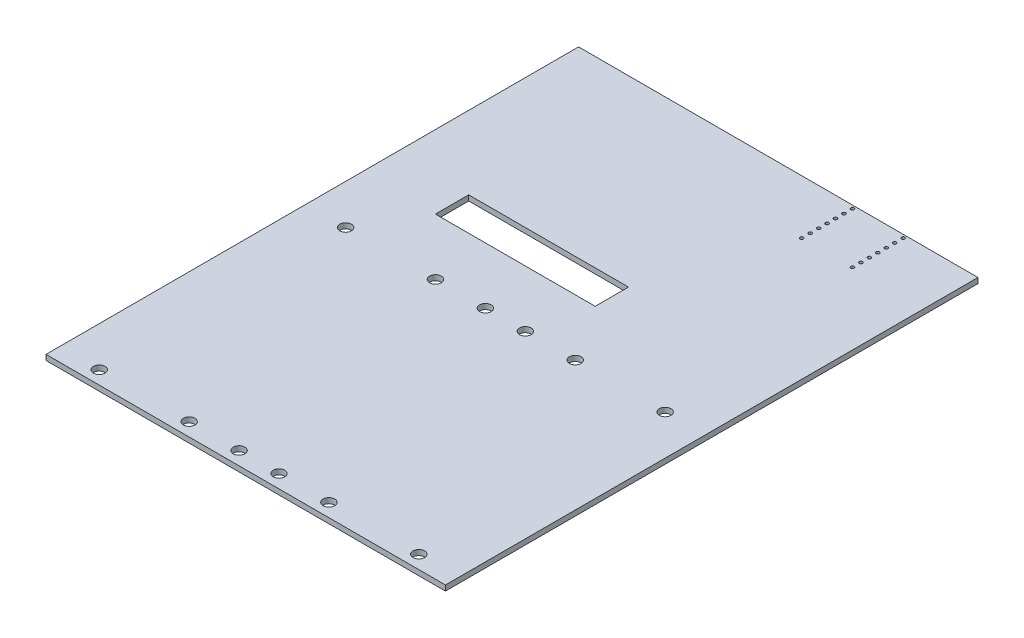
ISO-10303-21;
HEADER;
FILE_DESCRIPTION(('STEP AP214'),'2;1');
FILE_NAME('part.step','',(''),(''),'','','');
FILE_SCHEMA(('AUTOMOTIVE_DESIGN { 1 0 10303 214 1 1 1 1 }'));
ENDSEC;
DATA;
#1=APPLICATION_CONTEXT('core data for automotive mechanical design processes');
#2=APPLICATION_PROTOCOL_DEFINITION('international standard','automotive_design',2000,#1);
#3=PRODUCT_CONTEXT('',#1,'mechanical');
#4=PRODUCT('Part','Part','',(#3));
#5=PRODUCT_RELATED_PRODUCT_CATEGORY('part','',(#4));
#6=PRODUCT_DEFINITION_FORMATION('','',#4);
#7=PRODUCT_DEFINITION_CONTEXT('part definition',#1,'design');
#8=PRODUCT_DEFINITION('design','',#6,#7);
#9=PRODUCT_DEFINITION_SHAPE('','',#8);
#10=(LENGTH_UNIT() NAMED_UNIT(*) SI_UNIT(.MILLI.,.METRE.));
#11=(NAMED_UNIT(*) PLANE_ANGLE_UNIT() SI_UNIT($,.RADIAN.));
#12=(NAMED_UNIT(*) SI_UNIT($,.STERADIAN.) SOLID_ANGLE_UNIT());
#13=UNCERTAINTY_MEASURE_WITH_UNIT(LENGTH_MEASURE(1.E-05),#10,'distance_accuracy_value','');
#14=(GEOMETRIC_REPRESENTATION_CONTEXT(3) GLOBAL_UNCERTAINTY_ASSIGNED_CONTEXT((#13)) GLOBAL_UNIT_ASSIGNED_CONTEXT((#10,
#11,#12)) REPRESENTATION_CONTEXT('',''));
#15=CARTESIAN_POINT('',(0.,0.,0.));
#16=DIRECTION('',(0.,0.,1.));
#17=DIRECTION('',(1.,0.,0.));
#18=AXIS2_PLACEMENT_3D('',#15,#16,#17);
#19=CARTESIAN_POINT('',(0.,1.6,65.));
#20=DIRECTION('',(0.,0.,1.));
#21=DIRECTION('',(1.,0.,0.));
#22=AXIS2_PLACEMENT_3D('',#19,#20,#21);
#23=PLANE('',#22);
#24=DIRECTION('',(-1.,0.,0.));
#25=VECTOR('',#24,1.);
#26=CARTESIAN_POINT('',(0.,0.,65.));
#27=LINE('',#26,#25);
#28=CARTESIAN_POINT('',(70.,0.,65.));
#29=VERTEX_POINT('',#28);
#30=CARTESIAN_POINT('',(22.,0.,65.));
#31=VERTEX_POINT('',#30);
#32=EDGE_CURVE('E222',#29,#31,#27,.T.);
#33=ORIENTED_EDGE('',*,*,#32,.T.);
#34=DIRECTION('',(0.,-1.,0.));
#35=VECTOR('',#34,1.);
#36=CARTESIAN_POINT('',(22.,1.6,65.));
#37=LINE('',#36,#35);
#38=CARTESIAN_POINT('',(22.,1.6,65.));
#39=VERTEX_POINT('',#38);
#40=EDGE_CURVE('E11',#39,#31,#37,.T.);
#41=ORIENTED_EDGE('',*,*,#40,.F.);
#42=DIRECTION('',(-1.,0.,0.));
#43=VECTOR('',#42,1.);
#44=CARTESIAN_POINT('',(0.,1.6,65.));
#45=LINE('',#44,#43);
#46=CARTESIAN_POINT('',(70.,1.6,65.));
#47=VERTEX_POINT('',#46);
#48=EDGE_CURVE('E116',#47,#39,#45,.T.);
#49=ORIENTED_EDGE('',*,*,#48,.F.);
#50=DIRECTION('',(0.,-1.,0.));
#51=VECTOR('',#50,1.);
#52=CARTESIAN_POINT('',(70.,1.6,65.));
#53=LINE('',#52,#51);
#54=EDGE_CURVE('E54',#47,#29,#53,.T.);
#55=ORIENTED_EDGE('',*,*,#54,.T.);
#56=EDGE_LOOP('',(#33,#41,#49,#55));
#57=FACE_BOUND('',#56,.T.);
#58=ADVANCED_FACE('F35',(#57),#23,.F.);
#59=CARTESIAN_POINT('',(22.,1.6,0.));
#60=DIRECTION('',(-1.,0.,0.));
#61=DIRECTION('',(0.,0.,1.));
#62=AXIS2_PLACEMENT_3D('',#59,#60,#61);
#63=PLANE('',#62);
#64=DIRECTION('',(0.,0.,-1.));
#65=VECTOR('',#64,1.);
#66=CARTESIAN_POINT('',(22.,0.,0.));
#67=LINE('',#66,#65);
#68=CARTESIAN_POINT('',(22.,0.,55.));
#69=VERTEX_POINT('',#68);
#70=EDGE_CURVE('E122',#31,#69,#67,.T.);
#71=ORIENTED_EDGE('',*,*,#70,.T.);
#72=DIRECTION('',(0.,-1.,0.));
#73=VECTOR('',#72,1.);
#74=CARTESIAN_POINT('',(22.,1.6,55.));
#75=LINE('',#74,#73);
#76=CARTESIAN_POINT('',(22.,1.6,55.));
#77=VERTEX_POINT('',#76);
#78=EDGE_CURVE('E45',#77,#69,#75,.T.);
#79=ORIENTED_EDGE('',*,*,#78,.F.);
#80=DIRECTION('',(0.,0.,-1.));
#81=VECTOR('',#80,1.);
#82=CARTESIAN_POINT('',(22.,1.6,0.));
#83=LINE('',#82,#81);
#84=EDGE_CURVE('E109',#39,#77,#83,.T.);
#85=ORIENTED_EDGE('',*,*,#84,.F.);
#86=ORIENTED_EDGE('',*,*,#40,.T.);
#87=EDGE_LOOP('',(#71,#79,#85,#86));
#88=FACE_BOUND('',#87,.T.);
#89=ADVANCED_FACE('F121',(#88),#63,.F.);
#90=CARTESIAN_POINT('',(0.,1.6,55.));
#91=DIRECTION('',(0.,0.,1.));
#92=DIRECTION('',(1.,0.,0.));
#93=AXIS2_PLACEMENT_3D('',#90,#91,#92);
#94=PLANE('',#93);
#95=DIRECTION('',(-1.,0.,0.));
#96=VECTOR('',#95,1.);
#97=CARTESIAN_POINT('',(0.,0.,55.));
#98=LINE('',#97,#96);
#99=CARTESIAN_POINT('',(70.,0.,55.));
#100=VERTEX_POINT('',#99);
#101=EDGE_CURVE('E225',#100,#69,#98,.T.);
#102=ORIENTED_EDGE('',*,*,#101,.F.);
#103=DIRECTION('',(0.,-1.,0.));
#104=VECTOR('',#103,1.);
#105=CARTESIAN_POINT('',(70.,1.6,55.));
#106=LINE('',#105,#104);
#107=CARTESIAN_POINT('',(70.,1.6,55.));
#108=VERTEX_POINT('',#107);
#109=EDGE_CURVE('E80',#108,#100,#106,.T.);
#110=ORIENTED_EDGE('',*,*,#109,.F.);
#111=DIRECTION('',(-1.,0.,0.));
#112=VECTOR('',#111,1.);
#113=CARTESIAN_POINT('',(0.,1.6,55.));
#114=LINE('',#113,#112);
#115=EDGE_CURVE('E115',#108,#77,#114,.T.);
#116=ORIENTED_EDGE('',*,*,#115,.T.);
#117=ORIENTED_EDGE('',*,*,#78,.T.);
#118=EDGE_LOOP('',(#102,#110,#116,#117));
#119=FACE_BOUND('',#118,.T.);
#120=ADVANCED_FACE('F126',(#119),#94,.T.);
#121=CARTESIAN_POINT('',(0.,1.6,160.));
#122=DIRECTION('',(0.,0.,-1.));
#123=DIRECTION('',(-1.,0.,0.));
#124=AXIS2_PLACEMENT_3D('',#121,#122,#123);
#125=PLANE('',#124);
#126=DIRECTION('',(1.,0.,0.));
#127=VECTOR('',#126,1.);
#128=CARTESIAN_POINT('',(0.,0.,160.));
#129=LINE('',#128,#127);
#130=CARTESIAN_POINT('',(0.,0.,160.));
#131=VERTEX_POINT('',#130);
#132=CARTESIAN_POINT('',(120.,0.,160.));
#133=VERTEX_POINT('',#132);
#134=EDGE_CURVE('E211',#131,#133,#129,.T.);
#135=ORIENTED_EDGE('',*,*,#134,.T.);
#136=DIRECTION('',(0.,-1.,0.));
#137=VECTOR('',#136,1.);
#138=CARTESIAN_POINT('',(120.,1.6,160.));
#139=LINE('',#138,#137);
#140=CARTESIAN_POINT('',(120.,1.6,160.));
#141=VERTEX_POINT('',#140);
#142=EDGE_CURVE('E39',#141,#133,#139,.T.);
#143=ORIENTED_EDGE('',*,*,#142,.F.);
#144=DIRECTION('',(1.,0.,0.));
#145=VECTOR('',#144,1.);
#146=CARTESIAN_POINT('',(0.,1.6,160.));
#147=LINE('',#146,#145);
#148=CARTESIAN_POINT('',(0.,1.6,160.));
#149=VERTEX_POINT('',#148);
#150=EDGE_CURVE('E93',#149,#141,#147,.T.);
#151=ORIENTED_EDGE('',*,*,#150,.F.);
#152=DIRECTION('',(0.,-1.,0.));
#153=VECTOR('',#152,1.);
#154=CARTESIAN_POINT('',(0.,1.6,160.));
#155=LINE('',#154,#153);
#156=EDGE_CURVE('E210',#149,#131,#155,.T.);
#157=ORIENTED_EDGE('',*,*,#156,.T.);
#158=EDGE_LOOP('',(#135,#143,#151,#157));
#159=FACE_BOUND('',#158,.T.);
#160=ADVANCED_FACE('F37',(#159),#125,.F.);
#161=CARTESIAN_POINT('',(120.,1.6,0.));
#162=DIRECTION('',(1.,0.,0.));
#163=DIRECTION('',(0.,0.,-1.));
#164=AXIS2_PLACEMENT_3D('',#161,#162,#163);
#165=PLANE('',#164);
#166=DIRECTION('',(0.,0.,1.));
#167=VECTOR('',#166,1.);
#168=CARTESIAN_POINT('',(120.,0.,0.));
#169=LINE('',#168,#167);
#170=CARTESIAN_POINT('',(120.,0.,0.));
#171=VERTEX_POINT('',#170);
#172=EDGE_CURVE('E214',#171,#133,#169,.T.);
#173=ORIENTED_EDGE('',*,*,#172,.F.);
#174=DIRECTION('',(0.,-1.,0.));
#175=VECTOR('',#174,1.);
#176=CARTESIAN_POINT('',(120.,1.6,0.));
#177=LINE('',#176,#175);
#178=CARTESIAN_POINT('',(120.,1.6,0.));
#179=VERTEX_POINT('',#178);
#180=EDGE_CURVE('E313',#179,#171,#177,.T.);
#181=ORIENTED_EDGE('',*,*,#180,.F.);
#182=DIRECTION('',(0.,0.,1.));
#183=VECTOR('',#182,1.);
#184=CARTESIAN_POINT('',(120.,1.6,0.));
#185=LINE('',#184,#183);
#186=EDGE_CURVE('E321',#179,#141,#185,.T.);
#187=ORIENTED_EDGE('',*,*,#186,.T.);
#188=ORIENTED_EDGE('',*,*,#142,.T.);
#189=EDGE_LOOP('',(#173,#181,#187,#188));
#190=FACE_BOUND('',#189,.T.);
#191=ADVANCED_FACE('F320',(#190),#165,.T.);
#192=CARTESIAN_POINT('',(0.,1.6,0.));
#193=DIRECTION('',(0.,0.,-1.));
#194=DIRECTION('',(-1.,0.,0.));
#195=AXIS2_PLACEMENT_3D('',#192,#193,#194);
#196=PLANE('',#195);
#197=DIRECTION('',(1.,0.,0.));
#198=VECTOR('',#197,1.);
#199=CARTESIAN_POINT('',(0.,0.,0.));
#200=LINE('',#199,#198);
#201=CARTESIAN_POINT('',(0.,0.,0.));
#202=VERTEX_POINT('',#201);
#203=EDGE_CURVE('E217',#202,#171,#200,.T.);
#204=ORIENTED_EDGE('',*,*,#203,.F.);
#205=DIRECTION('',(0.,-1.,0.));
#206=VECTOR('',#205,1.);
#207=CARTESIAN_POINT('',(0.,1.6,0.));
#208=LINE('',#207,#206);
#209=CARTESIAN_POINT('',(0.,1.6,0.));
#210=VERTEX_POINT('',#209);
#211=EDGE_CURVE('E312',#210,#202,#208,.T.);
#212=ORIENTED_EDGE('',*,*,#211,.F.);
#213=DIRECTION('',(1.,0.,0.));
#214=VECTOR('',#213,1.);
#215=CARTESIAN_POINT('',(0.,1.6,0.));
#216=LINE('',#215,#214);
#217=EDGE_CURVE('E332',#210,#179,#216,.T.);
#218=ORIENTED_EDGE('',*,*,#217,.T.);
#219=ORIENTED_EDGE('',*,*,#180,.T.);
#220=EDGE_LOOP('',(#204,#212,#218,#219));
#221=FACE_BOUND('',#220,.T.);
#222=ADVANCED_FACE('F329',(#221),#196,.T.);
#223=CARTESIAN_POINT('',(12.,1.6,156.));
#224=DIRECTION('',(0.,-1.,0.));
#225=DIRECTION('',(0.,0.,-1.));
#226=AXIS2_PLACEMENT_3D('',#223,#224,#225);
#227=CYLINDRICAL_SURFACE('',#226,1.75);
#228=CARTESIAN_POINT('',(12.,1.6,156.));
#229=DIRECTION('',(0.,1.,0.));
#230=DIRECTION('',(0.,0.,1.));
#231=AXIS2_PLACEMENT_3D('',#228,#229,#230);
#232=CIRCLE('',#231,1.75);
#233=CARTESIAN_POINT('',(12.,1.6,157.75));
#234=VERTEX_POINT('',#233);
#235=EDGE_CURVE('E204',#234,#234,#232,.T.);
#236=ORIENTED_EDGE('',*,*,#235,.T.);
#237=EDGE_LOOP('',(#236));
#238=FACE_BOUND('',#237,.T.);
#239=CARTESIAN_POINT('',(12.,0.,156.));
#240=DIRECTION('',(0.,1.,0.));
#241=DIRECTION('',(0.,0.,1.));
#242=AXIS2_PLACEMENT_3D('',#239,#240,#241);
#243=CIRCLE('',#242,1.75);
#244=CARTESIAN_POINT('',(12.,0.,157.75));
#245=VERTEX_POINT('',#244);
#246=EDGE_CURVE('E302',#245,#245,#243,.T.);
#247=ORIENTED_EDGE('',*,*,#246,.F.);
#248=EDGE_LOOP('',(#247));
#249=FACE_BOUND('',#248,.T.);
#250=ADVANCED_FACE('F362',(#238,#249),#227,.F.);
#251=CARTESIAN_POINT('',(54.,1.6,82.));
#252=DIRECTION('',(0.,-1.,0.));
#253=DIRECTION('',(0.,0.,-1.));
#254=AXIS2_PLACEMENT_3D('',#251,#252,#253);
#255=CYLINDRICAL_SURFACE('',#254,1.75);
#256=CARTESIAN_POINT('',(54.,1.6,82.));
#257=DIRECTION('',(0.,1.,0.));
#258=DIRECTION('',(0.,0.,1.));
#259=AXIS2_PLACEMENT_3D('',#256,#257,#258);
#260=CIRCLE('',#259,1.75);
#261=CARTESIAN_POINT('',(54.,1.6,83.75));
#262=VERTEX_POINT('',#261);
#263=EDGE_CURVE('E201',#262,#262,#260,.T.);
#264=ORIENTED_EDGE('',*,*,#263,.T.);
#265=EDGE_LOOP('',(#264));
#266=FACE_BOUND('',#265,.T.);
#267=CARTESIAN_POINT('',(54.,0.,82.));
#268=DIRECTION('',(0.,1.,0.));
#269=DIRECTION('',(0.,0.,1.));
#270=AXIS2_PLACEMENT_3D('',#267,#268,#269);
#271=CIRCLE('',#270,1.75);
#272=CARTESIAN_POINT('',(54.,0.,83.75));
#273=VERTEX_POINT('',#272);
#274=EDGE_CURVE('E299',#273,#273,#271,.T.);
#275=ORIENTED_EDGE('',*,*,#274,.F.);
#276=EDGE_LOOP('',(#275));
#277=FACE_BOUND('',#276,.T.);
#278=ADVANCED_FACE('F466',(#266,#277),#255,.F.);
#279=CARTESIAN_POINT('',(54.,1.6,156.));
#280=DIRECTION('',(0.,-1.,0.));
#281=DIRECTION('',(0.,0.,-1.));
#282=AXIS2_PLACEMENT_3D('',#279,#280,#281);
#283=CYLINDRICAL_SURFACE('',#282,1.75);
#284=CARTESIAN_POINT('',(54.,1.6,156.));
#285=DIRECTION('',(0.,1.,0.));
#286=DIRECTION('',(0.,0.,1.));
#287=AXIS2_PLACEMENT_3D('',#284,#285,#286);
#288=CIRCLE('',#287,1.75);
#289=CARTESIAN_POINT('',(54.,1.6,157.75));
#290=VERTEX_POINT('',#289);
#291=EDGE_CURVE('E198',#290,#290,#288,.T.);
#292=ORIENTED_EDGE('',*,*,#291,.T.);
#293=EDGE_LOOP('',(#292));
#294=FACE_BOUND('',#293,.T.);
#295=CARTESIAN_POINT('',(54.,0.,156.));
#296=DIRECTION('',(0.,1.,0.));
#297=DIRECTION('',(0.,0.,1.));
#298=AXIS2_PLACEMENT_3D('',#295,#296,#297);
#299=CIRCLE('',#298,1.75);
#300=CARTESIAN_POINT('',(54.,0.,157.75));
#301=VERTEX_POINT('',#300);
#302=EDGE_CURVE('E296',#301,#301,#299,.T.);
#303=ORIENTED_EDGE('',*,*,#302,.F.);
#304=EDGE_LOOP('',(#303));
#305=FACE_BOUND('',#304,.T.);
#306=ADVANCED_FACE('F462',(#294,#305),#283,.F.);
#307=CARTESIAN_POINT('',(39.,1.6,156.));
#308=DIRECTION('',(0.,-1.,0.));
#309=DIRECTION('',(0.,0.,-1.));
#310=AXIS2_PLACEMENT_3D('',#307,#308,#309);
#311=CYLINDRICAL_SURFACE('',#310,1.75);
#312=CARTESIAN_POINT('',(39.,1.6,156.));
#313=DIRECTION('',(0.,1.,0.));
#314=DIRECTION('',(0.,0.,1.));
#315=AXIS2_PLACEMENT_3D('',#312,#313,#314);
#316=CIRCLE('',#315,1.75);
#317=CARTESIAN_POINT('',(39.,1.6,157.75));
#318=VERTEX_POINT('',#317);
#319=EDGE_CURVE('E195',#318,#318,#316,.T.);
#320=ORIENTED_EDGE('',*,*,#319,.T.);
#321=EDGE_LOOP('',(#320));
#322=FACE_BOUND('',#321,.T.);
#323=CARTESIAN_POINT('',(39.,0.,156.));
#324=DIRECTION('',(0.,1.,0.));
#325=DIRECTION('',(0.,0.,1.));
#326=AXIS2_PLACEMENT_3D('',#323,#324,#325);
#327=CIRCLE('',#326,1.75);
#328=CARTESIAN_POINT('',(39.,0.,157.75));
#329=VERTEX_POINT('',#328);
#330=EDGE_CURVE('E293',#329,#329,#327,.T.);
#331=ORIENTED_EDGE('',*,*,#330,.F.);
#332=EDGE_LOOP('',(#331));
#333=FACE_BOUND('',#332,.T.);
#334=ADVANCED_FACE('F458',(#322,#333),#311,.F.);
#335=CARTESIAN_POINT('',(39.,1.6,82.));
#336=DIRECTION('',(0.,-1.,0.));
#337=DIRECTION('',(0.,0.,-1.));
#338=AXIS2_PLACEMENT_3D('',#335,#336,#337);
#339=CYLINDRICAL_SURFACE('',#338,1.75);
#340=CARTESIAN_POINT('',(39.,1.6,82.));
#341=DIRECTION('',(0.,1.,0.));
#342=DIRECTION('',(0.,0.,1.));
#343=AXIS2_PLACEMENT_3D('',#340,#341,#342);
#344=CIRCLE('',#343,1.75);
#345=CARTESIAN_POINT('',(39.,1.6,83.75));
#346=VERTEX_POINT('',#345);
#347=EDGE_CURVE('E192',#346,#346,#344,.T.);
#348=ORIENTED_EDGE('',*,*,#347,.T.);
#349=EDGE_LOOP('',(#348));
#350=FACE_BOUND('',#349,.T.);
#351=CARTESIAN_POINT('',(39.,0.,82.));
#352=DIRECTION('',(0.,1.,0.));
#353=DIRECTION('',(0.,0.,1.));
#354=AXIS2_PLACEMENT_3D('',#351,#352,#353);
#355=CIRCLE('',#354,1.75);
#356=CARTESIAN_POINT('',(39.,0.,83.75));
#357=VERTEX_POINT('',#356);
#358=EDGE_CURVE('E290',#357,#357,#355,.T.);
#359=ORIENTED_EDGE('',*,*,#358,.F.);
#360=EDGE_LOOP('',(#359));
#361=FACE_BOUND('',#360,.T.);
#362=ADVANCED_FACE('F454',(#350,#361),#339,.F.);
#363=CARTESIAN_POINT('',(66.,1.6,82.));
#364=DIRECTION('',(0.,-1.,0.));
#365=DIRECTION('',(0.,0.,-1.));
#366=AXIS2_PLACEMENT_3D('',#363,#364,#365);
#367=CYLINDRICAL_SURFACE('',#366,1.75);
#368=CARTESIAN_POINT('',(66.,1.6,82.));
#369=DIRECTION('',(0.,1.,0.));
#370=DIRECTION('',(0.,0.,1.));
#371=AXIS2_PLACEMENT_3D('',#368,#369,#370);
#372=CIRCLE('',#371,1.75);
#373=CARTESIAN_POINT('',(66.,1.6,83.75));
#374=VERTEX_POINT('',#373);
#375=EDGE_CURVE('E189',#374,#374,#372,.T.);
#376=ORIENTED_EDGE('',*,*,#375,.T.);
#377=EDGE_LOOP('',(#376));
#378=FACE_BOUND('',#377,.T.);
#379=CARTESIAN_POINT('',(66.,0.,82.));
#380=DIRECTION('',(0.,1.,0.));
#381=DIRECTION('',(0.,0.,1.));
#382=AXIS2_PLACEMENT_3D('',#379,#380,#381);
#383=CIRCLE('',#382,1.75);
#384=CARTESIAN_POINT('',(66.,0.,83.75));
#385=VERTEX_POINT('',#384);
#386=EDGE_CURVE('E287',#385,#385,#383,.T.);
#387=ORIENTED_EDGE('',*,*,#386,.F.);
#388=EDGE_LOOP('',(#387));
#389=FACE_BOUND('',#388,.T.);
#390=ADVANCED_FACE('F450',(#378,#389),#367,.F.);
#391=CARTESIAN_POINT('',(66.,1.6,156.));
#392=DIRECTION('',(0.,-1.,0.));
#393=DIRECTION('',(0.,0.,-1.));
#394=AXIS2_PLACEMENT_3D('',#391,#392,#393);
#395=CYLINDRICAL_SURFACE('',#394,1.75);
#396=CARTESIAN_POINT('',(66.,1.6,156.));
#397=DIRECTION('',(0.,1.,0.));
#398=DIRECTION('',(0.,0.,1.));
#399=AXIS2_PLACEMENT_3D('',#396,#397,#398);
#400=CIRCLE('',#399,1.75);
#401=CARTESIAN_POINT('',(66.,1.6,157.75));
#402=VERTEX_POINT('',#401);
#403=EDGE_CURVE('E186',#402,#402,#400,.T.);
#404=ORIENTED_EDGE('',*,*,#403,.T.);
#405=EDGE_LOOP('',(#404));
#406=FACE_BOUND('',#405,.T.);
#407=CARTESIAN_POINT('',(66.,0.,156.));
#408=DIRECTION('',(0.,1.,0.));
#409=DIRECTION('',(0.,0.,1.));
#410=AXIS2_PLACEMENT_3D('',#407,#408,#409);
#411=CIRCLE('',#410,1.75);
#412=CARTESIAN_POINT('',(66.,0.,157.75));
#413=VERTEX_POINT('',#412);
#414=EDGE_CURVE('E284',#413,#413,#411,.T.);
#415=ORIENTED_EDGE('',*,*,#414,.F.);
#416=EDGE_LOOP('',(#415));
#417=FACE_BOUND('',#416,.T.);
#418=ADVANCED_FACE('F446',(#406,#417),#395,.F.);
#419=CARTESIAN_POINT('',(81.,1.6,156.));
#420=DIRECTION('',(0.,-1.,0.));
#421=DIRECTION('',(0.,0.,-1.));
#422=AXIS2_PLACEMENT_3D('',#419,#420,#421);
#423=CYLINDRICAL_SURFACE('',#422,1.75);
#424=CARTESIAN_POINT('',(81.,1.6,156.));
#425=DIRECTION('',(0.,1.,0.));
#426=DIRECTION('',(0.,0.,1.));
#427=AXIS2_PLACEMENT_3D('',#424,#425,#426);
#428=CIRCLE('',#427,1.75);
#429=CARTESIAN_POINT('',(81.,1.6,157.75));
#430=VERTEX_POINT('',#429);
#431=EDGE_CURVE('E183',#430,#430,#428,.T.);
#432=ORIENTED_EDGE('',*,*,#431,.T.);
#433=EDGE_LOOP('',(#432));
#434=FACE_BOUND('',#433,.T.);
#435=CARTESIAN_POINT('',(81.,0.,156.));
#436=DIRECTION('',(0.,1.,0.));
#437=DIRECTION('',(0.,0.,1.));
#438=AXIS2_PLACEMENT_3D('',#435,#436,#437);
#439=CIRCLE('',#438,1.75);
#440=CARTESIAN_POINT('',(81.,0.,157.75));
#441=VERTEX_POINT('',#440);
#442=EDGE_CURVE('E281',#441,#441,#439,.T.);
#443=ORIENTED_EDGE('',*,*,#442,.F.);
#444=EDGE_LOOP('',(#443));
#445=FACE_BOUND('',#444,.T.);
#446=ADVANCED_FACE('F442',(#434,#445),#423,.F.);
#447=CARTESIAN_POINT('',(81.,1.6,82.));
#448=DIRECTION('',(0.,-1.,0.));
#449=DIRECTION('',(0.,0.,-1.));
#450=AXIS2_PLACEMENT_3D('',#447,#448,#449);
#451=CYLINDRICAL_SURFACE('',#450,1.75);
#452=CARTESIAN_POINT('',(81.,1.6,82.));
#453=DIRECTION('',(0.,1.,0.));
#454=DIRECTION('',(0.,0.,1.));
#455=AXIS2_PLACEMENT_3D('',#452,#453,#454);
#456=CIRCLE('',#455,1.75);
#457=CARTESIAN_POINT('',(81.,1.6,83.75));
#458=VERTEX_POINT('',#457);
#459=EDGE_CURVE('E180',#458,#458,#456,.T.);
#460=ORIENTED_EDGE('',*,*,#459,.T.);
#461=EDGE_LOOP('',(#460));
#462=FACE_BOUND('',#461,.T.);
#463=CARTESIAN_POINT('',(81.,0.,82.));
#464=DIRECTION('',(0.,1.,0.));
#465=DIRECTION('',(0.,0.,1.));
#466=AXIS2_PLACEMENT_3D('',#463,#464,#465);
#467=CIRCLE('',#466,1.75);
#468=CARTESIAN_POINT('',(81.,0.,83.75));
#469=VERTEX_POINT('',#468);
#470=EDGE_CURVE('E278',#469,#469,#467,.T.);
#471=ORIENTED_EDGE('',*,*,#470,.F.);
#472=EDGE_LOOP('',(#471));
#473=FACE_BOUND('',#472,.T.);
#474=ADVANCED_FACE('F438',(#462,#473),#451,.F.);
#475=CARTESIAN_POINT('',(108.,1.6,82.));
#476=DIRECTION('',(0.,-1.,0.));
#477=DIRECTION('',(0.,0.,-1.));
#478=AXIS2_PLACEMENT_3D('',#475,#476,#477);
#479=CYLINDRICAL_SURFACE('',#478,1.75);
#480=CARTESIAN_POINT('',(108.,1.6,82.));
#481=DIRECTION('',(0.,1.,0.));
#482=DIRECTION('',(0.,0.,1.));
#483=AXIS2_PLACEMENT_3D('',#480,#481,#482);
#484=CIRCLE('',#483,1.75);
#485=CARTESIAN_POINT('',(108.,1.6,83.75));
#486=VERTEX_POINT('',#485);
#487=EDGE_CURVE('E177',#486,#486,#484,.T.);
#488=ORIENTED_EDGE('',*,*,#487,.T.);
#489=EDGE_LOOP('',(#488));
#490=FACE_BOUND('',#489,.T.);
#491=CARTESIAN_POINT('',(108.,0.,82.));
#492=DIRECTION('',(0.,1.,0.));
#493=DIRECTION('',(0.,0.,1.));
#494=AXIS2_PLACEMENT_3D('',#491,#492,#493);
#495=CIRCLE('',#494,1.75);
#496=CARTESIAN_POINT('',(108.,0.,83.75));
#497=VERTEX_POINT('',#496);
#498=EDGE_CURVE('E275',#497,#497,#495,.T.);
#499=ORIENTED_EDGE('',*,*,#498,.F.);
#500=EDGE_LOOP('',(#499));
#501=FACE_BOUND('',#500,.T.);
#502=ADVANCED_FACE('F434',(#490,#501),#479,.F.);
#503=CARTESIAN_POINT('',(108.,1.6,156.));
#504=DIRECTION('',(0.,-1.,0.));
#505=DIRECTION('',(0.,0.,-1.));
#506=AXIS2_PLACEMENT_3D('',#503,#504,#505);
#507=CYLINDRICAL_SURFACE('',#506,1.75);
#508=CARTESIAN_POINT('',(108.,1.6,156.));
#509=DIRECTION('',(0.,1.,0.));
#510=DIRECTION('',(0.,0.,1.));
#511=AXIS2_PLACEMENT_3D('',#508,#509,#510);
#512=CIRCLE('',#511,1.75);
#513=CARTESIAN_POINT('',(108.,1.6,157.75));
#514=VERTEX_POINT('',#513);
#515=EDGE_CURVE('E174',#514,#514,#512,.T.);
#516=ORIENTED_EDGE('',*,*,#515,.T.);
#517=EDGE_LOOP('',(#516));
#518=FACE_BOUND('',#517,.T.);
#519=CARTESIAN_POINT('',(108.,0.,156.));
#520=DIRECTION('',(0.,1.,0.));
#521=DIRECTION('',(0.,0.,1.));
#522=AXIS2_PLACEMENT_3D('',#519,#520,#521);
#523=CIRCLE('',#522,1.75);
#524=CARTESIAN_POINT('',(108.,0.,157.75));
#525=VERTEX_POINT('',#524);
#526=EDGE_CURVE('E272',#525,#525,#523,.T.);
#527=ORIENTED_EDGE('',*,*,#526,.F.);
#528=EDGE_LOOP('',(#527));
#529=FACE_BOUND('',#528,.T.);
#530=ADVANCED_FACE('F430',(#518,#529),#507,.F.);
#531=CARTESIAN_POINT('',(83.2575268007834,1.6,0.979999999999991));
#532=DIRECTION('',(0.,-1.,0.));
#533=DIRECTION('',(0.,0.,-1.));
#534=AXIS2_PLACEMENT_3D('',#531,#532,#533);
#535=CYLINDRICAL_SURFACE('',#534,0.499999999999999);
#536=CARTESIAN_POINT('',(83.2575268007834,1.6,0.979999999999991));
#537=DIRECTION('',(0.,1.,0.));
#538=DIRECTION('',(0.,0.,1.));
#539=AXIS2_PLACEMENT_3D('',#536,#537,#538);
#540=CIRCLE('',#539,0.499999999999999);
#541=CARTESIAN_POINT('',(83.2575268007834,1.6,1.47999999999999));
#542=VERTEX_POINT('',#541);
#543=EDGE_CURVE('E171',#542,#542,#540,.T.);
#544=ORIENTED_EDGE('',*,*,#543,.T.);
#545=EDGE_LOOP('',(#544));
#546=FACE_BOUND('',#545,.T.);
#547=CARTESIAN_POINT('',(83.2575268007834,0.,0.979999999999991));
#548=DIRECTION('',(0.,1.,0.));
#549=DIRECTION('',(0.,0.,1.));
#550=AXIS2_PLACEMENT_3D('',#547,#548,#549);
#551=CIRCLE('',#550,0.499999999999999);
#552=CARTESIAN_POINT('',(83.2575268007834,0.,1.47999999999999));
#553=VERTEX_POINT('',#552);
#554=EDGE_CURVE('E269',#553,#553,#551,.T.);
#555=ORIENTED_EDGE('',*,*,#554,.F.);
#556=EDGE_LOOP('',(#555));
#557=FACE_BOUND('',#556,.T.);
#558=ADVANCED_FACE('F426',(#546,#557),#535,.F.);
#559=CARTESIAN_POINT('',(98.4975268007834,1.6,0.979999999999991));
#560=DIRECTION('',(0.,-1.,0.));
#561=DIRECTION('',(0.,0.,-1.));
#562=AXIS2_PLACEMENT_3D('',#559,#560,#561);
#563=CYLINDRICAL_SURFACE('',#562,0.499999999999999);
#564=CARTESIAN_POINT('',(98.4975268007834,1.6,0.979999999999991));
#565=DIRECTION('',(0.,1.,0.));
#566=DIRECTION('',(0.,0.,1.));
#567=AXIS2_PLACEMENT_3D('',#564,#565,#566);
#568=CIRCLE('',#567,0.499999999999999);
#569=CARTESIAN_POINT('',(98.4975268007834,1.6,1.47999999999999));
#570=VERTEX_POINT('',#569);
#571=EDGE_CURVE('E168',#570,#570,#568,.T.);
#572=ORIENTED_EDGE('',*,*,#571,.T.);
#573=EDGE_LOOP('',(#572));
#574=FACE_BOUND('',#573,.T.);
#575=CARTESIAN_POINT('',(98.4975268007834,0.,0.979999999999991));
#576=DIRECTION('',(0.,1.,0.));
#577=DIRECTION('',(0.,0.,1.));
#578=AXIS2_PLACEMENT_3D('',#575,#576,#577);
#579=CIRCLE('',#578,0.499999999999999);
#580=CARTESIAN_POINT('',(98.4975268007834,0.,1.47999999999999));
#581=VERTEX_POINT('',#580);
#582=EDGE_CURVE('E266',#581,#581,#579,.T.);
#583=ORIENTED_EDGE('',*,*,#582,.F.);
#584=EDGE_LOOP('',(#583));
#585=FACE_BOUND('',#584,.T.);
#586=ADVANCED_FACE('F422',(#574,#585),#563,.F.);
#587=CARTESIAN_POINT('',(98.4975268007834,1.6,3.51999999999999));
#588=DIRECTION('',(0.,-1.,0.));
#589=DIRECTION('',(0.,0.,-1.));
#590=AXIS2_PLACEMENT_3D('',#587,#588,#589);
#591=CYLINDRICAL_SURFACE('',#590,0.499999999999999);
#592=CARTESIAN_POINT('',(98.4975268007834,1.6,3.51999999999999));
#593=DIRECTION('',(0.,1.,0.));
#594=DIRECTION('',(0.,0.,1.));
#595=AXIS2_PLACEMENT_3D('',#592,#593,#594);
#596=CIRCLE('',#595,0.499999999999999);
#597=CARTESIAN_POINT('',(98.4975268007834,1.6,4.01999999999999));
#598=VERTEX_POINT('',#597);
#599=EDGE_CURVE('E165',#598,#598,#596,.T.);
#600=ORIENTED_EDGE('',*,*,#599,.T.);
#601=EDGE_LOOP('',(#600));
#602=FACE_BOUND('',#601,.T.);
#603=CARTESIAN_POINT('',(98.4975268007834,0.,3.51999999999999));
#604=DIRECTION('',(0.,1.,0.));
#605=DIRECTION('',(0.,0.,1.));
#606=AXIS2_PLACEMENT_3D('',#603,#604,#605);
#607=CIRCLE('',#606,0.499999999999999);
#608=CARTESIAN_POINT('',(98.4975268007834,0.,4.01999999999999));
#609=VERTEX_POINT('',#608);
#610=EDGE_CURVE('E263',#609,#609,#607,.T.);
#611=ORIENTED_EDGE('',*,*,#610,.F.);
#612=EDGE_LOOP('',(#611));
#613=FACE_BOUND('',#612,.T.);
#614=ADVANCED_FACE('F418',(#602,#613),#591,.F.);
#615=CARTESIAN_POINT('',(98.4975268007834,1.6,6.05999999999999));
#616=DIRECTION('',(0.,-1.,0.));
#617=DIRECTION('',(0.,0.,-1.));
#618=AXIS2_PLACEMENT_3D('',#615,#616,#617);
#619=CYLINDRICAL_SURFACE('',#618,0.499999999999999);
#620=CARTESIAN_POINT('',(98.4975268007834,1.6,6.05999999999999));
#621=DIRECTION('',(0.,1.,0.));
#622=DIRECTION('',(0.,0.,1.));
#623=AXIS2_PLACEMENT_3D('',#620,#621,#622);
#624=CIRCLE('',#623,0.499999999999999);
#625=CARTESIAN_POINT('',(98.4975268007834,1.6,6.55999999999998));
#626=VERTEX_POINT('',#625);
#627=EDGE_CURVE('E162',#626,#626,#624,.T.);
#628=ORIENTED_EDGE('',*,*,#627,.T.);
#629=EDGE_LOOP('',(#628));
#630=FACE_BOUND('',#629,.T.);
#631=CARTESIAN_POINT('',(98.4975268007834,0.,6.05999999999999));
#632=DIRECTION('',(0.,1.,0.));
#633=DIRECTION('',(0.,0.,1.));
#634=AXIS2_PLACEMENT_3D('',#631,#632,#633);
#635=CIRCLE('',#634,0.499999999999999);
#636=CARTESIAN_POINT('',(98.4975268007834,0.,6.55999999999998));
#637=VERTEX_POINT('',#636);
#638=EDGE_CURVE('E260',#637,#637,#635,.T.);
#639=ORIENTED_EDGE('',*,*,#638,.F.);
#640=EDGE_LOOP('',(#639));
#641=FACE_BOUND('',#640,.T.);
#642=ADVANCED_FACE('F414',(#630,#641),#619,.F.);
#643=CARTESIAN_POINT('',(98.4975268007834,1.6,8.59999999999998));
#644=DIRECTION('',(0.,-1.,0.));
#645=DIRECTION('',(0.,0.,-1.));
#646=AXIS2_PLACEMENT_3D('',#643,#644,#645);
#647=CYLINDRICAL_SURFACE('',#646,0.499999999999999);
#648=CARTESIAN_POINT('',(98.4975268007834,1.6,8.59999999999998));
#649=DIRECTION('',(0.,1.,0.));
#650=DIRECTION('',(0.,0.,1.));
#651=AXIS2_PLACEMENT_3D('',#648,#649,#650);
#652=CIRCLE('',#651,0.499999999999999);
#653=CARTESIAN_POINT('',(98.4975268007834,1.6,9.09999999999998));
#654=VERTEX_POINT('',#653);
#655=EDGE_CURVE('E159',#654,#654,#652,.T.);
#656=ORIENTED_EDGE('',*,*,#655,.T.);
#657=EDGE_LOOP('',(#656));
#658=FACE_BOUND('',#657,.T.);
#659=CARTESIAN_POINT('',(98.4975268007834,0.,8.59999999999998));
#660=DIRECTION('',(0.,1.,0.));
#661=DIRECTION('',(0.,0.,1.));
#662=AXIS2_PLACEMENT_3D('',#659,#660,#661);
#663=CIRCLE('',#662,0.499999999999999);
#664=CARTESIAN_POINT('',(98.4975268007834,0.,9.09999999999998));
#665=VERTEX_POINT('',#664);
#666=EDGE_CURVE('E257',#665,#665,#663,.T.);
#667=ORIENTED_EDGE('',*,*,#666,.F.);
#668=EDGE_LOOP('',(#667));
#669=FACE_BOUND('',#668,.T.);
#670=ADVANCED_FACE('F410',(#658,#669),#647,.F.);
#671=CARTESIAN_POINT('',(98.4975268007834,1.6,11.14));
#672=DIRECTION('',(0.,-1.,0.));
#673=DIRECTION('',(0.,0.,-1.));
#674=AXIS2_PLACEMENT_3D('',#671,#672,#673);
#675=CYLINDRICAL_SURFACE('',#674,0.499999999999999);
#676=CARTESIAN_POINT('',(98.4975268007834,1.6,11.14));
#677=DIRECTION('',(0.,1.,0.));
#678=DIRECTION('',(0.,0.,1.));
#679=AXIS2_PLACEMENT_3D('',#676,#677,#678);
#680=CIRCLE('',#679,0.499999999999999);
#681=CARTESIAN_POINT('',(98.4975268007834,1.6,11.64));
#682=VERTEX_POINT('',#681);
#683=EDGE_CURVE('E156',#682,#682,#680,.T.);
#684=ORIENTED_EDGE('',*,*,#683,.T.);
#685=EDGE_LOOP('',(#684));
#686=FACE_BOUND('',#685,.T.);
#687=CARTESIAN_POINT('',(98.4975268007834,0.,11.14));
#688=DIRECTION('',(0.,1.,0.));
#689=DIRECTION('',(0.,0.,1.));
#690=AXIS2_PLACEMENT_3D('',#687,#688,#689);
#691=CIRCLE('',#690,0.499999999999999);
#692=CARTESIAN_POINT('',(98.4975268007834,0.,11.64));
#693=VERTEX_POINT('',#692);
#694=EDGE_CURVE('E254',#693,#693,#691,.T.);
#695=ORIENTED_EDGE('',*,*,#694,.F.);
#696=EDGE_LOOP('',(#695));
#697=FACE_BOUND('',#696,.T.);
#698=ADVANCED_FACE('F406',(#686,#697),#675,.F.);
#699=CARTESIAN_POINT('',(98.4975268007834,1.6,13.68));
#700=DIRECTION('',(0.,-1.,0.));
#701=DIRECTION('',(0.,0.,-1.));
#702=AXIS2_PLACEMENT_3D('',#699,#700,#701);
#703=CYLINDRICAL_SURFACE('',#702,0.499999999999999);
#704=CARTESIAN_POINT('',(98.4975268007834,1.6,13.68));
#705=DIRECTION('',(0.,1.,0.));
#706=DIRECTION('',(0.,0.,1.));
#707=AXIS2_PLACEMENT_3D('',#704,#705,#706);
#708=CIRCLE('',#707,0.499999999999999);
#709=CARTESIAN_POINT('',(98.4975268007834,1.6,14.18));
#710=VERTEX_POINT('',#709);
#711=EDGE_CURVE('E153',#710,#710,#708,.T.);
#712=ORIENTED_EDGE('',*,*,#711,.T.);
#713=EDGE_LOOP('',(#712));
#714=FACE_BOUND('',#713,.T.);
#715=CARTESIAN_POINT('',(98.4975268007834,0.,13.68));
#716=DIRECTION('',(0.,1.,0.));
#717=DIRECTION('',(0.,0.,1.));
#718=AXIS2_PLACEMENT_3D('',#715,#716,#717);
#719=CIRCLE('',#718,0.499999999999999);
#720=CARTESIAN_POINT('',(98.4975268007834,0.,14.18));
#721=VERTEX_POINT('',#720);
#722=EDGE_CURVE('E251',#721,#721,#719,.T.);
#723=ORIENTED_EDGE('',*,*,#722,.F.);
#724=EDGE_LOOP('',(#723));
#725=FACE_BOUND('',#724,.T.);
#726=ADVANCED_FACE('F402',(#714,#725),#703,.F.);
#727=CARTESIAN_POINT('',(98.4975268007834,1.6,16.22));
#728=DIRECTION('',(0.,-1.,0.));
#729=DIRECTION('',(0.,0.,-1.));
#730=AXIS2_PLACEMENT_3D('',#727,#728,#729);
#731=CYLINDRICAL_SURFACE('',#730,0.499999999999999);
#732=CARTESIAN_POINT('',(98.4975268007834,1.6,16.22));
#733=DIRECTION('',(0.,1.,0.));
#734=DIRECTION('',(0.,0.,1.));
#735=AXIS2_PLACEMENT_3D('',#732,#733,#734);
#736=CIRCLE('',#735,0.499999999999999);
#737=CARTESIAN_POINT('',(98.4975268007834,1.6,16.72));
#738=VERTEX_POINT('',#737);
#739=EDGE_CURVE('E150',#738,#738,#736,.T.);
#740=ORIENTED_EDGE('',*,*,#739,.T.);
#741=EDGE_LOOP('',(#740));
#742=FACE_BOUND('',#741,.T.);
#743=CARTESIAN_POINT('',(98.4975268007834,0.,16.22));
#744=DIRECTION('',(0.,1.,0.));
#745=DIRECTION('',(0.,0.,1.));
#746=AXIS2_PLACEMENT_3D('',#743,#744,#745);
#747=CIRCLE('',#746,0.499999999999999);
#748=CARTESIAN_POINT('',(98.4975268007834,0.,16.72));
#749=VERTEX_POINT('',#748);
#750=EDGE_CURVE('E248',#749,#749,#747,.T.);
#751=ORIENTED_EDGE('',*,*,#750,.F.);
#752=EDGE_LOOP('',(#751));
#753=FACE_BOUND('',#752,.T.);
#754=ADVANCED_FACE('F398',(#742,#753),#731,.F.);
#755=CARTESIAN_POINT('',(83.2575268007834,1.6,3.51999999999999));
#756=DIRECTION('',(0.,-1.,0.));
#757=DIRECTION('',(0.,0.,-1.));
#758=AXIS2_PLACEMENT_3D('',#755,#756,#757);
#759=CYLINDRICAL_SURFACE('',#758,0.499999999999999);
#760=CARTESIAN_POINT('',(83.2575268007834,1.6,3.51999999999999));
#761=DIRECTION('',(0.,1.,0.));
#762=DIRECTION('',(0.,0.,1.));
#763=AXIS2_PLACEMENT_3D('',#760,#761,#762);
#764=CIRCLE('',#763,0.499999999999999);
#765=CARTESIAN_POINT('',(83.2575268007834,1.6,4.01999999999999));
#766=VERTEX_POINT('',#765);
#767=EDGE_CURVE('E147',#766,#766,#764,.T.);
#768=ORIENTED_EDGE('',*,*,#767,.T.);
#769=EDGE_LOOP('',(#768));
#770=FACE_BOUND('',#769,.T.);
#771=CARTESIAN_POINT('',(83.2575268007834,0.,3.51999999999999));
#772=DIRECTION('',(0.,1.,0.));
#773=DIRECTION('',(0.,0.,1.));
#774=AXIS2_PLACEMENT_3D('',#771,#772,#773);
#775=CIRCLE('',#774,0.499999999999999);
#776=CARTESIAN_POINT('',(83.2575268007834,0.,4.01999999999999));
#777=VERTEX_POINT('',#776);
#778=EDGE_CURVE('E245',#777,#777,#775,.T.);
#779=ORIENTED_EDGE('',*,*,#778,.F.);
#780=EDGE_LOOP('',(#779));
#781=FACE_BOUND('',#780,.T.);
#782=ADVANCED_FACE('F394',(#770,#781),#759,.F.);
#783=CARTESIAN_POINT('',(83.2575268007834,1.6,6.05999999999999));
#784=DIRECTION('',(0.,-1.,0.));
#785=DIRECTION('',(0.,0.,-1.));
#786=AXIS2_PLACEMENT_3D('',#783,#784,#785);
#787=CYLINDRICAL_SURFACE('',#786,0.499999999999999);
#788=CARTESIAN_POINT('',(83.2575268007834,1.6,6.05999999999999));
#789=DIRECTION('',(0.,1.,0.));
#790=DIRECTION('',(0.,0.,1.));
#791=AXIS2_PLACEMENT_3D('',#788,#789,#790);
#792=CIRCLE('',#791,0.499999999999999);
#793=CARTESIAN_POINT('',(83.2575268007834,1.6,6.55999999999998));
#794=VERTEX_POINT('',#793);
#795=EDGE_CURVE('E144',#794,#794,#792,.T.);
#796=ORIENTED_EDGE('',*,*,#795,.T.);
#797=EDGE_LOOP('',(#796));
#798=FACE_BOUND('',#797,.T.);
#799=CARTESIAN_POINT('',(83.2575268007834,0.,6.05999999999999));
#800=DIRECTION('',(0.,1.,0.));
#801=DIRECTION('',(0.,0.,1.));
#802=AXIS2_PLACEMENT_3D('',#799,#800,#801);
#803=CIRCLE('',#802,0.499999999999999);
#804=CARTESIAN_POINT('',(83.2575268007834,0.,6.55999999999998));
#805=VERTEX_POINT('',#804);
#806=EDGE_CURVE('E242',#805,#805,#803,.T.);
#807=ORIENTED_EDGE('',*,*,#806,.F.);
#808=EDGE_LOOP('',(#807));
#809=FACE_BOUND('',#808,.T.);
#810=ADVANCED_FACE('F390',(#798,#809),#787,.F.);
#811=CARTESIAN_POINT('',(83.2575268007834,1.6,8.59999999999998));
#812=DIRECTION('',(0.,-1.,0.));
#813=DIRECTION('',(0.,0.,-1.));
#814=AXIS2_PLACEMENT_3D('',#811,#812,#813);
#815=CYLINDRICAL_SURFACE('',#814,0.499999999999999);
#816=CARTESIAN_POINT('',(83.2575268007834,1.6,8.59999999999998));
#817=DIRECTION('',(0.,1.,0.));
#818=DIRECTION('',(0.,0.,1.));
#819=AXIS2_PLACEMENT_3D('',#816,#817,#818);
#820=CIRCLE('',#819,0.499999999999999);
#821=CARTESIAN_POINT('',(83.2575268007834,1.6,9.09999999999998));
#822=VERTEX_POINT('',#821);
#823=EDGE_CURVE('E141',#822,#822,#820,.T.);
#824=ORIENTED_EDGE('',*,*,#823,.T.);
#825=EDGE_LOOP('',(#824));
#826=FACE_BOUND('',#825,.T.);
#827=CARTESIAN_POINT('',(83.2575268007834,0.,8.59999999999998));
#828=DIRECTION('',(0.,1.,0.));
#829=DIRECTION('',(0.,0.,1.));
#830=AXIS2_PLACEMENT_3D('',#827,#828,#829);
#831=CIRCLE('',#830,0.499999999999999);
#832=CARTESIAN_POINT('',(83.2575268007834,0.,9.09999999999998));
#833=VERTEX_POINT('',#832);
#834=EDGE_CURVE('E239',#833,#833,#831,.T.);
#835=ORIENTED_EDGE('',*,*,#834,.F.);
#836=EDGE_LOOP('',(#835));
#837=FACE_BOUND('',#836,.T.);
#838=ADVANCED_FACE('F386',(#826,#837),#815,.F.);
#839=CARTESIAN_POINT('',(83.2575268007834,1.6,11.14));
#840=DIRECTION('',(0.,-1.,0.));
#841=DIRECTION('',(0.,0.,-1.));
#842=AXIS2_PLACEMENT_3D('',#839,#840,#841);
#843=CYLINDRICAL_SURFACE('',#842,0.499999999999999);
#844=CARTESIAN_POINT('',(83.2575268007834,1.6,11.14));
#845=DIRECTION('',(0.,1.,0.));
#846=DIRECTION('',(0.,0.,1.));
#847=AXIS2_PLACEMENT_3D('',#844,#845,#846);
#848=CIRCLE('',#847,0.499999999999999);
#849=CARTESIAN_POINT('',(83.2575268007834,1.6,11.64));
#850=VERTEX_POINT('',#849);
#851=EDGE_CURVE('E138',#850,#850,#848,.T.);
#852=ORIENTED_EDGE('',*,*,#851,.T.);
#853=EDGE_LOOP('',(#852));
#854=FACE_BOUND('',#853,.T.);
#855=CARTESIAN_POINT('',(83.2575268007834,0.,11.14));
#856=DIRECTION('',(0.,1.,0.));
#857=DIRECTION('',(0.,0.,1.));
#858=AXIS2_PLACEMENT_3D('',#855,#856,#857);
#859=CIRCLE('',#858,0.499999999999999);
#860=CARTESIAN_POINT('',(83.2575268007834,0.,11.64));
#861=VERTEX_POINT('',#860);
#862=EDGE_CURVE('E236',#861,#861,#859,.T.);
#863=ORIENTED_EDGE('',*,*,#862,.F.);
#864=EDGE_LOOP('',(#863));
#865=FACE_BOUND('',#864,.T.);
#866=ADVANCED_FACE('F382',(#854,#865),#843,.F.);
#867=CARTESIAN_POINT('',(83.2575268007834,1.6,13.68));
#868=DIRECTION('',(0.,-1.,0.));
#869=DIRECTION('',(0.,0.,-1.));
#870=AXIS2_PLACEMENT_3D('',#867,#868,#869);
#871=CYLINDRICAL_SURFACE('',#870,0.499999999999999);
#872=CARTESIAN_POINT('',(83.2575268007834,1.6,13.68));
#873=DIRECTION('',(0.,1.,0.));
#874=DIRECTION('',(0.,0.,1.));
#875=AXIS2_PLACEMENT_3D('',#872,#873,#874);
#876=CIRCLE('',#875,0.499999999999999);
#877=CARTESIAN_POINT('',(83.2575268007834,1.6,14.18));
#878=VERTEX_POINT('',#877);
#879=EDGE_CURVE('E135',#878,#878,#876,.T.);
#880=ORIENTED_EDGE('',*,*,#879,.T.);
#881=EDGE_LOOP('',(#880));
#882=FACE_BOUND('',#881,.T.);
#883=CARTESIAN_POINT('',(83.2575268007834,0.,13.68));
#884=DIRECTION('',(0.,1.,0.));
#885=DIRECTION('',(0.,0.,1.));
#886=AXIS2_PLACEMENT_3D('',#883,#884,#885);
#887=CIRCLE('',#886,0.499999999999999);
#888=CARTESIAN_POINT('',(83.2575268007834,0.,14.18));
#889=VERTEX_POINT('',#888);
#890=EDGE_CURVE('E233',#889,#889,#887,.T.);
#891=ORIENTED_EDGE('',*,*,#890,.F.);
#892=EDGE_LOOP('',(#891));
#893=FACE_BOUND('',#892,.T.);
#894=ADVANCED_FACE('F378',(#882,#893),#871,.F.);
#895=CARTESIAN_POINT('',(83.2575268007834,1.6,16.22));
#896=DIRECTION('',(0.,-1.,0.));
#897=DIRECTION('',(0.,0.,-1.));
#898=AXIS2_PLACEMENT_3D('',#895,#896,#897);
#899=CYLINDRICAL_SURFACE('',#898,0.499999999999999);
#900=CARTESIAN_POINT('',(83.2575268007834,1.6,16.22));
#901=DIRECTION('',(0.,1.,0.));
#902=DIRECTION('',(0.,0.,1.));
#903=AXIS2_PLACEMENT_3D('',#900,#901,#902);
#904=CIRCLE('',#903,0.499999999999999);
#905=CARTESIAN_POINT('',(83.2575268007834,1.6,16.72));
#906=VERTEX_POINT('',#905);
#907=EDGE_CURVE('E129',#906,#906,#904,.T.);
#908=ORIENTED_EDGE('',*,*,#907,.T.);
#909=EDGE_LOOP('',(#908));
#910=FACE_BOUND('',#909,.T.);
#911=CARTESIAN_POINT('',(83.2575268007834,0.,16.22));
#912=DIRECTION('',(0.,1.,0.));
#913=DIRECTION('',(0.,0.,1.));
#914=AXIS2_PLACEMENT_3D('',#911,#912,#913);
#915=CIRCLE('',#914,0.499999999999999);
#916=CARTESIAN_POINT('',(83.2575268007834,0.,16.72));
#917=VERTEX_POINT('',#916);
#918=EDGE_CURVE('E230',#917,#917,#915,.T.);
#919=ORIENTED_EDGE('',*,*,#918,.F.);
#920=EDGE_LOOP('',(#919));
#921=FACE_BOUND('',#920,.T.);
#922=ADVANCED_FACE('F375',(#910,#921),#899,.F.);
#923=CARTESIAN_POINT('',(70.,1.6,0.));
#924=DIRECTION('',(-1.,0.,0.));
#925=DIRECTION('',(0.,0.,1.));
#926=AXIS2_PLACEMENT_3D('',#923,#924,#925);
#927=PLANE('',#926);
#928=DIRECTION('',(0.,0.,-1.));
#929=VECTOR('',#928,1.);
#930=CARTESIAN_POINT('',(70.,0.,0.));
#931=LINE('',#930,#929);
#932=EDGE_CURVE('E227',#29,#100,#931,.T.);
#933=ORIENTED_EDGE('',*,*,#932,.F.);
#934=ORIENTED_EDGE('',*,*,#54,.F.);
#935=DIRECTION('',(0.,0.,-1.));
#936=VECTOR('',#935,1.);
#937=CARTESIAN_POINT('',(70.,1.6,0.));
#938=LINE('',#937,#936);
#939=EDGE_CURVE('E127',#47,#108,#938,.T.);
#940=ORIENTED_EDGE('',*,*,#939,.T.);
#941=ORIENTED_EDGE('',*,*,#109,.T.);
#942=EDGE_LOOP('',(#933,#934,#940,#941));
#943=FACE_BOUND('',#942,.T.);
#944=ADVANCED_FACE('F360',(#943),#927,.T.);
#945=CARTESIAN_POINT('',(0.,1.6,0.));
#946=DIRECTION('',(1.,0.,0.));
#947=DIRECTION('',(0.,0.,-1.));
#948=AXIS2_PLACEMENT_3D('',#945,#946,#947);
#949=PLANE('',#948);
#950=DIRECTION('',(0.,0.,1.));
#951=VECTOR('',#950,1.);
#952=CARTESIAN_POINT('',(0.,0.,0.));
#953=LINE('',#952,#951);
#954=EDGE_CURVE('E220',#202,#131,#953,.T.);
#955=ORIENTED_EDGE('',*,*,#954,.T.);
#956=ORIENTED_EDGE('',*,*,#156,.F.);
#957=DIRECTION('',(0.,0.,1.));
#958=VECTOR('',#957,1.);
#959=CARTESIAN_POINT('',(0.,1.6,0.));
#960=LINE('',#959,#958);
#961=EDGE_CURVE('E334',#210,#149,#960,.T.);
#962=ORIENTED_EDGE('',*,*,#961,.F.);
#963=ORIENTED_EDGE('',*,*,#211,.T.);
#964=EDGE_LOOP('',(#955,#956,#962,#963));
#965=FACE_BOUND('',#964,.T.);
#966=ADVANCED_FACE('F335',(#965),#949,.F.);
#967=CARTESIAN_POINT('',(12.,1.6,82.));
#968=DIRECTION('',(0.,-1.,0.));
#969=DIRECTION('',(0.,0.,-1.));
#970=AXIS2_PLACEMENT_3D('',#967,#968,#969);
#971=CYLINDRICAL_SURFACE('',#970,1.75);
#972=CARTESIAN_POINT('',(12.,1.6,82.));
#973=DIRECTION('',(0.,1.,0.));
#974=DIRECTION('',(0.,0.,1.));
#975=AXIS2_PLACEMENT_3D('',#972,#973,#974);
#976=CIRCLE('',#975,1.75);
#977=CARTESIAN_POINT('',(12.,1.6,83.75));
#978=VERTEX_POINT('',#977);
#979=EDGE_CURVE('E207',#978,#978,#976,.T.);
#980=ORIENTED_EDGE('',*,*,#979,.T.);
#981=EDGE_LOOP('',(#980));
#982=FACE_BOUND('',#981,.T.);
#983=CARTESIAN_POINT('',(12.,0.,82.));
#984=DIRECTION('',(0.,1.,0.));
#985=DIRECTION('',(0.,0.,1.));
#986=AXIS2_PLACEMENT_3D('',#983,#984,#985);
#987=CIRCLE('',#986,1.75);
#988=CARTESIAN_POINT('',(12.,0.,83.75));
#989=VERTEX_POINT('',#988);
#990=EDGE_CURVE('E305',#989,#989,#987,.T.);
#991=ORIENTED_EDGE('',*,*,#990,.F.);
#992=EDGE_LOOP('',(#991));
#993=FACE_BOUND('',#992,.T.);
#994=ADVANCED_FACE('F341',(#982,#993),#971,.F.);
#995=CARTESIAN_POINT('',(0.,1.6,0.));
#996=DIRECTION('',(0.,1.,0.));
#997=DIRECTION('',(0.,0.,1.));
#998=AXIS2_PLACEMENT_3D('',#995,#996,#997);
#999=PLANE('',#998);
#1000=ORIENTED_EDGE('',*,*,#150,.T.);
#1001=ORIENTED_EDGE('',*,*,#186,.F.);
#1002=ORIENTED_EDGE('',*,*,#217,.F.);
#1003=ORIENTED_EDGE('',*,*,#961,.T.);
#1004=EDGE_LOOP('',(#1000,#1001,#1002,#1003));
#1005=FACE_BOUND('',#1004,.T.);
#1006=ORIENTED_EDGE('',*,*,#48,.T.);
#1007=ORIENTED_EDGE('',*,*,#84,.T.);
#1008=ORIENTED_EDGE('',*,*,#115,.F.);
#1009=ORIENTED_EDGE('',*,*,#939,.F.);
#1010=EDGE_LOOP('',(#1006,#1007,#1008,#1009));
#1011=FACE_BOUND('',#1010,.T.);
#1012=ORIENTED_EDGE('',*,*,#907,.F.);
#1013=EDGE_LOOP('',(#1012));
#1014=FACE_BOUND('',#1013,.T.);
#1015=ORIENTED_EDGE('',*,*,#879,.F.);
#1016=EDGE_LOOP('',(#1015));
#1017=FACE_BOUND('',#1016,.T.);
#1018=ORIENTED_EDGE('',*,*,#851,.F.);
#1019=EDGE_LOOP('',(#1018));
#1020=FACE_BOUND('',#1019,.T.);
#1021=ORIENTED_EDGE('',*,*,#823,.F.);
#1022=EDGE_LOOP('',(#1021));
#1023=FACE_BOUND('',#1022,.T.);
#1024=ORIENTED_EDGE('',*,*,#795,.F.);
#1025=EDGE_LOOP('',(#1024));
#1026=FACE_BOUND('',#1025,.T.);
#1027=ORIENTED_EDGE('',*,*,#767,.F.);
#1028=EDGE_LOOP('',(#1027));
#1029=FACE_BOUND('',#1028,.T.);
#1030=ORIENTED_EDGE('',*,*,#739,.F.);
#1031=EDGE_LOOP('',(#1030));
#1032=FACE_BOUND('',#1031,.T.);
#1033=ORIENTED_EDGE('',*,*,#711,.F.);
#1034=EDGE_LOOP('',(#1033));
#1035=FACE_BOUND('',#1034,.T.);
#1036=ORIENTED_EDGE('',*,*,#683,.F.);
#1037=EDGE_LOOP('',(#1036));
#1038=FACE_BOUND('',#1037,.T.);
#1039=ORIENTED_EDGE('',*,*,#655,.F.);
#1040=EDGE_LOOP('',(#1039));
#1041=FACE_BOUND('',#1040,.T.);
#1042=ORIENTED_EDGE('',*,*,#627,.F.);
#1043=EDGE_LOOP('',(#1042));
#1044=FACE_BOUND('',#1043,.T.);
#1045=ORIENTED_EDGE('',*,*,#599,.F.);
#1046=EDGE_LOOP('',(#1045));
#1047=FACE_BOUND('',#1046,.T.);
#1048=ORIENTED_EDGE('',*,*,#571,.F.);
#1049=EDGE_LOOP('',(#1048));
#1050=FACE_BOUND('',#1049,.T.);
#1051=ORIENTED_EDGE('',*,*,#543,.F.);
#1052=EDGE_LOOP('',(#1051));
#1053=FACE_BOUND('',#1052,.T.);
#1054=ORIENTED_EDGE('',*,*,#515,.F.);
#1055=EDGE_LOOP('',(#1054));
#1056=FACE_BOUND('',#1055,.T.);
#1057=ORIENTED_EDGE('',*,*,#487,.F.);
#1058=EDGE_LOOP('',(#1057));
#1059=FACE_BOUND('',#1058,.T.);
#1060=ORIENTED_EDGE('',*,*,#459,.F.);
#1061=EDGE_LOOP('',(#1060));
#1062=FACE_BOUND('',#1061,.T.);
#1063=ORIENTED_EDGE('',*,*,#431,.F.);
#1064=EDGE_LOOP('',(#1063));
#1065=FACE_BOUND('',#1064,.T.);
#1066=ORIENTED_EDGE('',*,*,#403,.F.);
#1067=EDGE_LOOP('',(#1066));
#1068=FACE_BOUND('',#1067,.T.);
#1069=ORIENTED_EDGE('',*,*,#375,.F.);
#1070=EDGE_LOOP('',(#1069));
#1071=FACE_BOUND('',#1070,.T.);
#1072=ORIENTED_EDGE('',*,*,#347,.F.);
#1073=EDGE_LOOP('',(#1072));
#1074=FACE_BOUND('',#1073,.T.);
#1075=ORIENTED_EDGE('',*,*,#319,.F.);
#1076=EDGE_LOOP('',(#1075));
#1077=FACE_BOUND('',#1076,.T.);
#1078=ORIENTED_EDGE('',*,*,#291,.F.);
#1079=EDGE_LOOP('',(#1078));
#1080=FACE_BOUND('',#1079,.T.);
#1081=ORIENTED_EDGE('',*,*,#263,.F.);
#1082=EDGE_LOOP('',(#1081));
#1083=FACE_BOUND('',#1082,.T.);
#1084=ORIENTED_EDGE('',*,*,#235,.F.);
#1085=EDGE_LOOP('',(#1084));
#1086=FACE_BOUND('',#1085,.T.);
#1087=ORIENTED_EDGE('',*,*,#979,.F.);
#1088=EDGE_LOOP('',(#1087));
#1089=FACE_BOUND('',#1088,.T.);
#1090=ADVANCED_FACE('F111',(#1005,#1011,#1014,#1017,#1020,#1023,#1026,#1029,#1032,#1035,#1038,
#1041,#1044,#1047,#1050,#1053,#1056,#1059,#1062,#1065,#1068,#1071,#1074,#1077,#1080,#1083,#1086,
#1089),#999,.T.);
#1091=CARTESIAN_POINT('',(0.,0.,0.));
#1092=DIRECTION('',(0.,1.,0.));
#1093=DIRECTION('',(0.,0.,1.));
#1094=AXIS2_PLACEMENT_3D('',#1091,#1092,#1093);
#1095=PLANE('',#1094);
#1096=ORIENTED_EDGE('',*,*,#134,.F.);
#1097=ORIENTED_EDGE('',*,*,#954,.F.);
#1098=ORIENTED_EDGE('',*,*,#203,.T.);
#1099=ORIENTED_EDGE('',*,*,#172,.T.);
#1100=EDGE_LOOP('',(#1096,#1097,#1098,#1099));
#1101=FACE_BOUND('',#1100,.T.);
#1102=ORIENTED_EDGE('',*,*,#32,.F.);
#1103=ORIENTED_EDGE('',*,*,#932,.T.);
#1104=ORIENTED_EDGE('',*,*,#101,.T.);
#1105=ORIENTED_EDGE('',*,*,#70,.F.);
#1106=EDGE_LOOP('',(#1102,#1103,#1104,#1105));
#1107=FACE_BOUND('',#1106,.T.);
#1108=ORIENTED_EDGE('',*,*,#918,.T.);
#1109=EDGE_LOOP('',(#1108));
#1110=FACE_BOUND('',#1109,.T.);
#1111=ORIENTED_EDGE('',*,*,#890,.T.);
#1112=EDGE_LOOP('',(#1111));
#1113=FACE_BOUND('',#1112,.T.);
#1114=ORIENTED_EDGE('',*,*,#862,.T.);
#1115=EDGE_LOOP('',(#1114));
#1116=FACE_BOUND('',#1115,.T.);
#1117=ORIENTED_EDGE('',*,*,#834,.T.);
#1118=EDGE_LOOP('',(#1117));
#1119=FACE_BOUND('',#1118,.T.);
#1120=ORIENTED_EDGE('',*,*,#806,.T.);
#1121=EDGE_LOOP('',(#1120));
#1122=FACE_BOUND('',#1121,.T.);
#1123=ORIENTED_EDGE('',*,*,#778,.T.);
#1124=EDGE_LOOP('',(#1123));
#1125=FACE_BOUND('',#1124,.T.);
#1126=ORIENTED_EDGE('',*,*,#750,.T.);
#1127=EDGE_LOOP('',(#1126));
#1128=FACE_BOUND('',#1127,.T.);
#1129=ORIENTED_EDGE('',*,*,#722,.T.);
#1130=EDGE_LOOP('',(#1129));
#1131=FACE_BOUND('',#1130,.T.);
#1132=ORIENTED_EDGE('',*,*,#694,.T.);
#1133=EDGE_LOOP('',(#1132));
#1134=FACE_BOUND('',#1133,.T.);
#1135=ORIENTED_EDGE('',*,*,#666,.T.);
#1136=EDGE_LOOP('',(#1135));
#1137=FACE_BOUND('',#1136,.T.);
#1138=ORIENTED_EDGE('',*,*,#638,.T.);
#1139=EDGE_LOOP('',(#1138));
#1140=FACE_BOUND('',#1139,.T.);
#1141=ORIENTED_EDGE('',*,*,#610,.T.);
#1142=EDGE_LOOP('',(#1141));
#1143=FACE_BOUND('',#1142,.T.);
#1144=ORIENTED_EDGE('',*,*,#582,.T.);
#1145=EDGE_LOOP('',(#1144));
#1146=FACE_BOUND('',#1145,.T.);
#1147=ORIENTED_EDGE('',*,*,#554,.T.);
#1148=EDGE_LOOP('',(#1147));
#1149=FACE_BOUND('',#1148,.T.);
#1150=ORIENTED_EDGE('',*,*,#526,.T.);
#1151=EDGE_LOOP('',(#1150));
#1152=FACE_BOUND('',#1151,.T.);
#1153=ORIENTED_EDGE('',*,*,#498,.T.);
#1154=EDGE_LOOP('',(#1153));
#1155=FACE_BOUND('',#1154,.T.);
#1156=ORIENTED_EDGE('',*,*,#470,.T.);
#1157=EDGE_LOOP('',(#1156));
#1158=FACE_BOUND('',#1157,.T.);
#1159=ORIENTED_EDGE('',*,*,#442,.T.);
#1160=EDGE_LOOP('',(#1159));
#1161=FACE_BOUND('',#1160,.T.);
#1162=ORIENTED_EDGE('',*,*,#414,.T.);
#1163=EDGE_LOOP('',(#1162));
#1164=FACE_BOUND('',#1163,.T.);
#1165=ORIENTED_EDGE('',*,*,#386,.T.);
#1166=EDGE_LOOP('',(#1165));
#1167=FACE_BOUND('',#1166,.T.);
#1168=ORIENTED_EDGE('',*,*,#358,.T.);
#1169=EDGE_LOOP('',(#1168));
#1170=FACE_BOUND('',#1169,.T.);
#1171=ORIENTED_EDGE('',*,*,#330,.T.);
#1172=EDGE_LOOP('',(#1171));
#1173=FACE_BOUND('',#1172,.T.);
#1174=ORIENTED_EDGE('',*,*,#302,.T.);
#1175=EDGE_LOOP('',(#1174));
#1176=FACE_BOUND('',#1175,.T.);
#1177=ORIENTED_EDGE('',*,*,#274,.T.);
#1178=EDGE_LOOP('',(#1177));
#1179=FACE_BOUND('',#1178,.T.);
#1180=ORIENTED_EDGE('',*,*,#246,.T.);
#1181=EDGE_LOOP('',(#1180));
#1182=FACE_BOUND('',#1181,.T.);
#1183=ORIENTED_EDGE('',*,*,#990,.T.);
#1184=EDGE_LOOP('',(#1183));
#1185=FACE_BOUND('',#1184,.T.);
#1186=ADVANCED_FACE('F327',(#1101,#1107,#1110,#1113,#1116,#1119,#1122,#1125,#1128,#1131,#1134,
#1137,#1140,#1143,#1146,#1149,#1152,#1155,#1158,#1161,#1164,#1167,#1170,#1173,#1176,#1179,#1182,
#1185),#1095,.F.);
#1187=CLOSED_SHELL('',(#58,#89,#120,#160,#191,#222,#250,#278,#306,#334,#362,#390,#418,#446,#474,
#502,#530,#558,#586,#614,#642,#670,#698,#726,#754,#782,#810,#838,#866,#894,#922,#944,#966,#994,
#1090,#1186));
#1188=MANIFOLD_SOLID_BREP('B2',#1187);
#1189=ADVANCED_BREP_SHAPE_REPRESENTATION('',(#18,#1188),#14);
#1190=SHAPE_DEFINITION_REPRESENTATION(#9,#1189);
ENDSEC;
END-ISO-10303-21;
